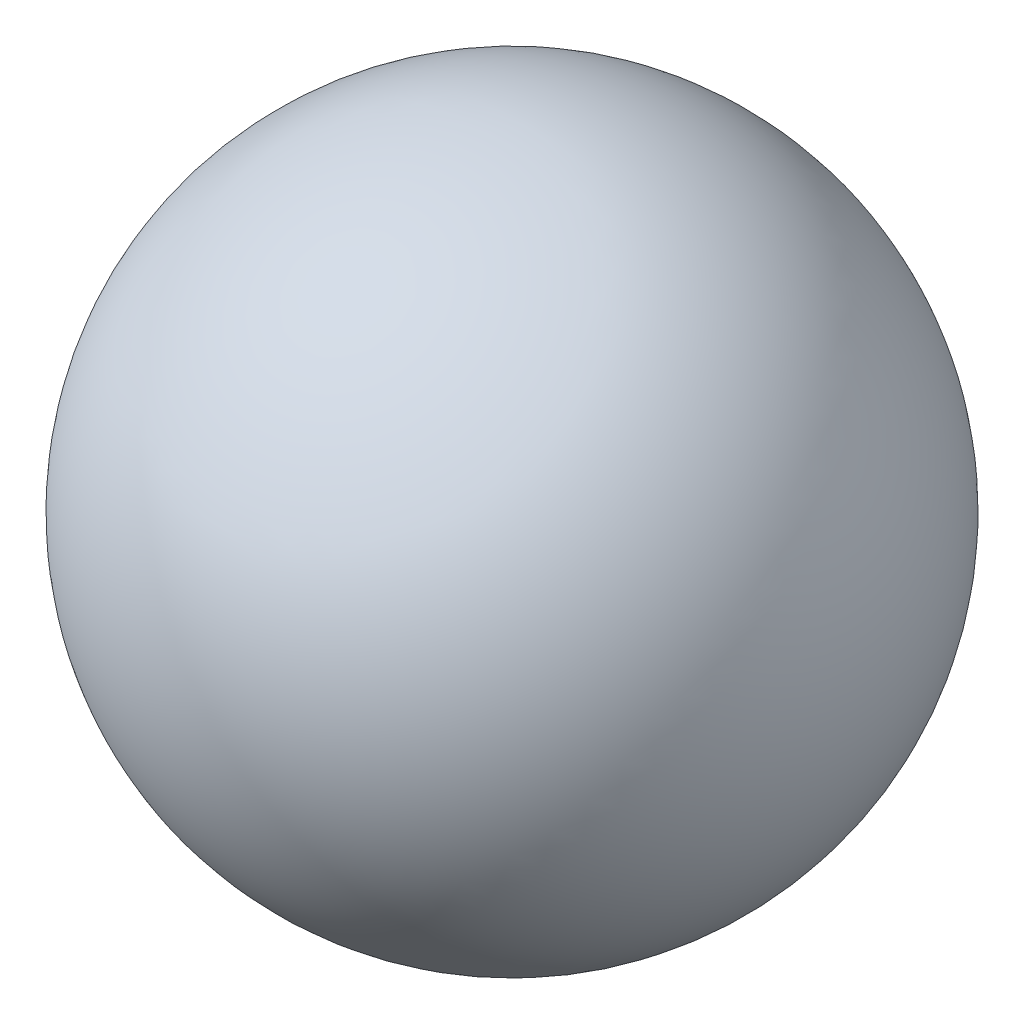
ISO-10303-21;
HEADER;
FILE_DESCRIPTION(('STEP AP214'),'2;1');
FILE_NAME('part.step','',(''),(''),'','','');
FILE_SCHEMA(('AUTOMOTIVE_DESIGN { 1 0 10303 214 1 1 1 1 }'));
ENDSEC;
DATA;
#1=APPLICATION_CONTEXT('core data for automotive mechanical design processes');
#2=APPLICATION_PROTOCOL_DEFINITION('international standard','automotive_design',2000,#1);
#3=PRODUCT_CONTEXT('',#1,'mechanical');
#4=PRODUCT('Part','Part','',(#3));
#5=PRODUCT_RELATED_PRODUCT_CATEGORY('part','',(#4));
#6=PRODUCT_DEFINITION_FORMATION('','',#4);
#7=PRODUCT_DEFINITION_CONTEXT('part definition',#1,'design');
#8=PRODUCT_DEFINITION('design','',#6,#7);
#9=PRODUCT_DEFINITION_SHAPE('','',#8);
#10=(LENGTH_UNIT() NAMED_UNIT(*) SI_UNIT(.MILLI.,.METRE.));
#11=(NAMED_UNIT(*) PLANE_ANGLE_UNIT() SI_UNIT($,.RADIAN.));
#12=(NAMED_UNIT(*) SI_UNIT($,.STERADIAN.) SOLID_ANGLE_UNIT());
#13=UNCERTAINTY_MEASURE_WITH_UNIT(LENGTH_MEASURE(1.E-05),#10,'distance_accuracy_value','');
#14=(GEOMETRIC_REPRESENTATION_CONTEXT(3) GLOBAL_UNCERTAINTY_ASSIGNED_CONTEXT((#13)) GLOBAL_UNIT_ASSIGNED_CONTEXT((#10,
#11,#12)) REPRESENTATION_CONTEXT('',''));
#15=CARTESIAN_POINT('',(0.,0.,0.));
#16=DIRECTION('',(0.,0.,1.));
#17=DIRECTION('',(1.,0.,0.));
#18=AXIS2_PLACEMENT_3D('',#15,#16,#17);
#19=CARTESIAN_POINT('',(-7.26336808809211,-2.,-9.23612386322775));
#20=DIRECTION('',(0.,0.,1.));
#21=DIRECTION('',(1.,0.,0.));
#22=AXIS2_PLACEMENT_3D('',#19,#20,#21);
#23=SPHERICAL_SURFACE('',#22,1.05);
#24=CARTESIAN_POINT('',(-7.26336808809211,-2.,-8.18612386322775));
#25=VERTEX_POINT('',#24);
#26=VERTEX_LOOP('',#25);
#27=FACE_BOUND('',#26,.T.);
#28=ADVANCED_FACE('F13',(#27),#23,.T.);
#29=CLOSED_SHELL('',(#28));
#30=MANIFOLD_SOLID_BREP('B1',#29);
#31=ADVANCED_BREP_SHAPE_REPRESENTATION('',(#18,#30),#14);
#32=SHAPE_DEFINITION_REPRESENTATION(#9,#31);
ENDSEC;
END-ISO-10303-21;
